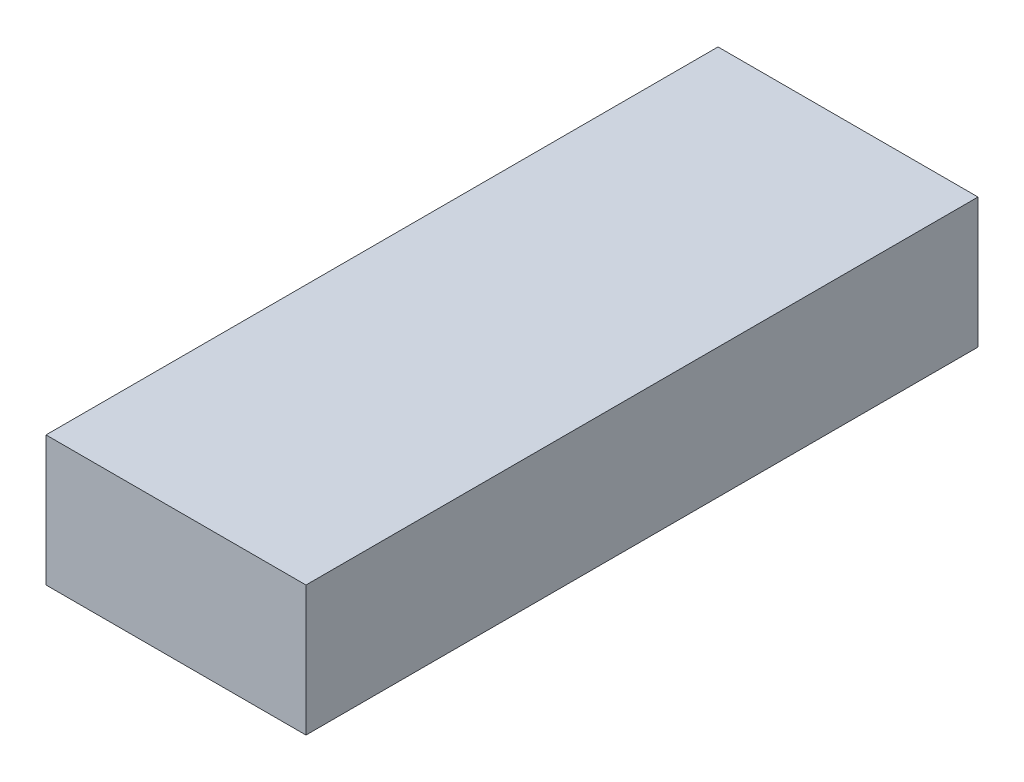
ISO-10303-21;
HEADER;
FILE_DESCRIPTION(('STEP AP214'),'2;1');
FILE_NAME('part.step','',(''),(''),'','','');
FILE_SCHEMA(('AUTOMOTIVE_DESIGN { 1 0 10303 214 1 1 1 1 }'));
ENDSEC;
DATA;
#1=APPLICATION_CONTEXT('core data for automotive mechanical design processes');
#2=APPLICATION_PROTOCOL_DEFINITION('international standard','automotive_design',2000,#1);
#3=PRODUCT_CONTEXT('',#1,'mechanical');
#4=PRODUCT('Part','Part','',(#3));
#5=PRODUCT_RELATED_PRODUCT_CATEGORY('part','',(#4));
#6=PRODUCT_DEFINITION_FORMATION('','',#4);
#7=PRODUCT_DEFINITION_CONTEXT('part definition',#1,'design');
#8=PRODUCT_DEFINITION('design','',#6,#7);
#9=PRODUCT_DEFINITION_SHAPE('','',#8);
#10=(LENGTH_UNIT() NAMED_UNIT(*) SI_UNIT(.MILLI.,.METRE.));
#11=(NAMED_UNIT(*) PLANE_ANGLE_UNIT() SI_UNIT($,.RADIAN.));
#12=(NAMED_UNIT(*) SI_UNIT($,.STERADIAN.) SOLID_ANGLE_UNIT());
#13=UNCERTAINTY_MEASURE_WITH_UNIT(LENGTH_MEASURE(1.E-05),#10,'distance_accuracy_value','');
#14=(GEOMETRIC_REPRESENTATION_CONTEXT(3) GLOBAL_UNCERTAINTY_ASSIGNED_CONTEXT((#13)) GLOBAL_UNIT_ASSIGNED_CONTEXT((#10,
#11,#12)) REPRESENTATION_CONTEXT('',''));
#15=CARTESIAN_POINT('',(0.,0.,0.));
#16=DIRECTION('',(0.,0.,1.));
#17=DIRECTION('',(1.,0.,0.));
#18=AXIS2_PLACEMENT_3D('',#15,#16,#17);
#19=CARTESIAN_POINT('',(-10.,5.,51.7));
#20=DIRECTION('',(1.,0.,0.));
#21=DIRECTION('',(0.,1.,0.));
#22=AXIS2_PLACEMENT_3D('',#19,#20,#21);
#23=PLANE('',#22);
#24=DIRECTION('',(0.,-1.,0.));
#25=VECTOR('',#24,1.);
#26=CARTESIAN_POINT('',(-10.,5.,0.));
#27=LINE('',#26,#25);
#28=CARTESIAN_POINT('',(-10.,5.,0.));
#29=VERTEX_POINT('',#28);
#30=CARTESIAN_POINT('',(-10.,-5.,0.));
#31=VERTEX_POINT('',#30);
#32=EDGE_CURVE('E94',#29,#31,#27,.T.);
#33=ORIENTED_EDGE('',*,*,#32,.T.);
#34=DIRECTION('',(0.,0.,-1.));
#35=VECTOR('',#34,1.);
#36=CARTESIAN_POINT('',(-10.,-5.,51.7));
#37=LINE('',#36,#35);
#38=CARTESIAN_POINT('',(-10.,-5.,51.7));
#39=VERTEX_POINT('',#38);
#40=EDGE_CURVE('E11',#39,#31,#37,.T.);
#41=ORIENTED_EDGE('',*,*,#40,.F.);
#42=DIRECTION('',(0.,-1.,0.));
#43=VECTOR('',#42,1.);
#44=CARTESIAN_POINT('',(-10.,5.,51.7));
#45=LINE('',#44,#43);
#46=CARTESIAN_POINT('',(-10.,5.,51.7));
#47=VERTEX_POINT('',#46);
#48=EDGE_CURVE('E82',#47,#39,#45,.T.);
#49=ORIENTED_EDGE('',*,*,#48,.F.);
#50=DIRECTION('',(0.,0.,-1.));
#51=VECTOR('',#50,1.);
#52=CARTESIAN_POINT('',(-10.,5.,51.7));
#53=LINE('',#52,#51);
#54=EDGE_CURVE('E90',#47,#29,#53,.T.);
#55=ORIENTED_EDGE('',*,*,#54,.T.);
#56=EDGE_LOOP('',(#33,#41,#49,#55));
#57=FACE_BOUND('',#56,.T.);
#58=ADVANCED_FACE('F31',(#57),#23,.F.);
#59=CARTESIAN_POINT('',(-10.,-5.,51.7));
#60=DIRECTION('',(0.,1.,0.));
#61=DIRECTION('',(0.,0.,1.));
#62=AXIS2_PLACEMENT_3D('',#59,#60,#61);
#63=PLANE('',#62);
#64=DIRECTION('',(1.,0.,0.));
#65=VECTOR('',#64,1.);
#66=CARTESIAN_POINT('',(-10.,-5.,0.));
#67=LINE('',#66,#65);
#68=CARTESIAN_POINT('',(10.,-5.,0.));
#69=VERTEX_POINT('',#68);
#70=EDGE_CURVE('E86',#31,#69,#67,.T.);
#71=ORIENTED_EDGE('',*,*,#70,.T.);
#72=DIRECTION('',(0.,0.,-1.));
#73=VECTOR('',#72,1.);
#74=CARTESIAN_POINT('',(10.,-5.,51.7));
#75=LINE('',#74,#73);
#76=CARTESIAN_POINT('',(10.,-5.,51.7));
#77=VERTEX_POINT('',#76);
#78=EDGE_CURVE('E39',#77,#69,#75,.T.);
#79=ORIENTED_EDGE('',*,*,#78,.F.);
#80=DIRECTION('',(1.,0.,0.));
#81=VECTOR('',#80,1.);
#82=CARTESIAN_POINT('',(-10.,-5.,51.7));
#83=LINE('',#82,#81);
#84=EDGE_CURVE('E77',#39,#77,#83,.T.);
#85=ORIENTED_EDGE('',*,*,#84,.F.);
#86=ORIENTED_EDGE('',*,*,#40,.T.);
#87=EDGE_LOOP('',(#71,#79,#85,#86));
#88=FACE_BOUND('',#87,.T.);
#89=ADVANCED_FACE('F85',(#88),#63,.F.);
#90=CARTESIAN_POINT('',(10.,5.,51.7));
#91=DIRECTION('',(-1.,0.,0.));
#92=DIRECTION('',(0.,-1.,0.));
#93=AXIS2_PLACEMENT_3D('',#90,#91,#92);
#94=PLANE('',#93);
#95=DIRECTION('',(0.,1.,0.));
#96=VECTOR('',#95,1.);
#97=CARTESIAN_POINT('',(10.,5.,0.));
#98=LINE('',#97,#96);
#99=CARTESIAN_POINT('',(10.,5.,0.));
#100=VERTEX_POINT('',#99);
#101=EDGE_CURVE('E64',#69,#100,#98,.T.);
#102=ORIENTED_EDGE('',*,*,#101,.T.);
#103=DIRECTION('',(0.,0.,-1.));
#104=VECTOR('',#103,1.);
#105=CARTESIAN_POINT('',(10.,5.,51.7));
#106=LINE('',#105,#104);
#107=CARTESIAN_POINT('',(10.,5.,51.7));
#108=VERTEX_POINT('',#107);
#109=EDGE_CURVE('E87',#108,#100,#106,.T.);
#110=ORIENTED_EDGE('',*,*,#109,.F.);
#111=DIRECTION('',(0.,1.,0.));
#112=VECTOR('',#111,1.);
#113=CARTESIAN_POINT('',(10.,5.,51.7));
#114=LINE('',#113,#112);
#115=EDGE_CURVE('E80',#77,#108,#114,.T.);
#116=ORIENTED_EDGE('',*,*,#115,.F.);
#117=ORIENTED_EDGE('',*,*,#78,.T.);
#118=EDGE_LOOP('',(#102,#110,#116,#117));
#119=FACE_BOUND('',#118,.T.);
#120=ADVANCED_FACE('F88',(#119),#94,.F.);
#121=CARTESIAN_POINT('',(-10.,5.,51.7));
#122=DIRECTION('',(0.,-1.,0.));
#123=DIRECTION('',(0.,0.,-1.));
#124=AXIS2_PLACEMENT_3D('',#121,#122,#123);
#125=PLANE('',#124);
#126=DIRECTION('',(-1.,0.,0.));
#127=VECTOR('',#126,1.);
#128=CARTESIAN_POINT('',(-10.,5.,0.));
#129=LINE('',#128,#127);
#130=EDGE_CURVE('E70',#100,#29,#129,.T.);
#131=ORIENTED_EDGE('',*,*,#130,.T.);
#132=ORIENTED_EDGE('',*,*,#54,.F.);
#133=DIRECTION('',(-1.,0.,0.));
#134=VECTOR('',#133,1.);
#135=CARTESIAN_POINT('',(-10.,5.,51.7));
#136=LINE('',#135,#134);
#137=EDGE_CURVE('E47',#108,#47,#136,.T.);
#138=ORIENTED_EDGE('',*,*,#137,.F.);
#139=ORIENTED_EDGE('',*,*,#109,.T.);
#140=EDGE_LOOP('',(#131,#132,#138,#139));
#141=FACE_BOUND('',#140,.T.);
#142=ADVANCED_FACE('F101',(#141),#125,.F.);
#143=CARTESIAN_POINT('',(-10.,-5.,51.7));
#144=DIRECTION('',(0.,0.,1.));
#145=DIRECTION('',(1.,0.,0.));
#146=AXIS2_PLACEMENT_3D('',#143,#144,#145);
#147=PLANE('',#146);
#148=ORIENTED_EDGE('',*,*,#48,.T.);
#149=ORIENTED_EDGE('',*,*,#84,.T.);
#150=ORIENTED_EDGE('',*,*,#115,.T.);
#151=ORIENTED_EDGE('',*,*,#137,.T.);
#152=EDGE_LOOP('',(#148,#149,#150,#151));
#153=FACE_BOUND('',#152,.T.);
#154=ADVANCED_FACE('F78',(#153),#147,.T.);
#155=CARTESIAN_POINT('',(-10.,-5.,0.));
#156=DIRECTION('',(0.,0.,1.));
#157=DIRECTION('',(1.,0.,0.));
#158=AXIS2_PLACEMENT_3D('',#155,#156,#157);
#159=PLANE('',#158);
#160=ORIENTED_EDGE('',*,*,#32,.F.);
#161=ORIENTED_EDGE('',*,*,#130,.F.);
#162=ORIENTED_EDGE('',*,*,#101,.F.);
#163=ORIENTED_EDGE('',*,*,#70,.F.);
#164=EDGE_LOOP('',(#160,#161,#162,#163));
#165=FACE_BOUND('',#164,.T.);
#166=ADVANCED_FACE('F104',(#165),#159,.F.);
#167=CLOSED_SHELL('',(#58,#89,#120,#142,#154,#166));
#168=MANIFOLD_SOLID_BREP('B2',#167);
#169=ADVANCED_BREP_SHAPE_REPRESENTATION('',(#18,#168),#14);
#170=SHAPE_DEFINITION_REPRESENTATION(#9,#169);
ENDSEC;
END-ISO-10303-21;
